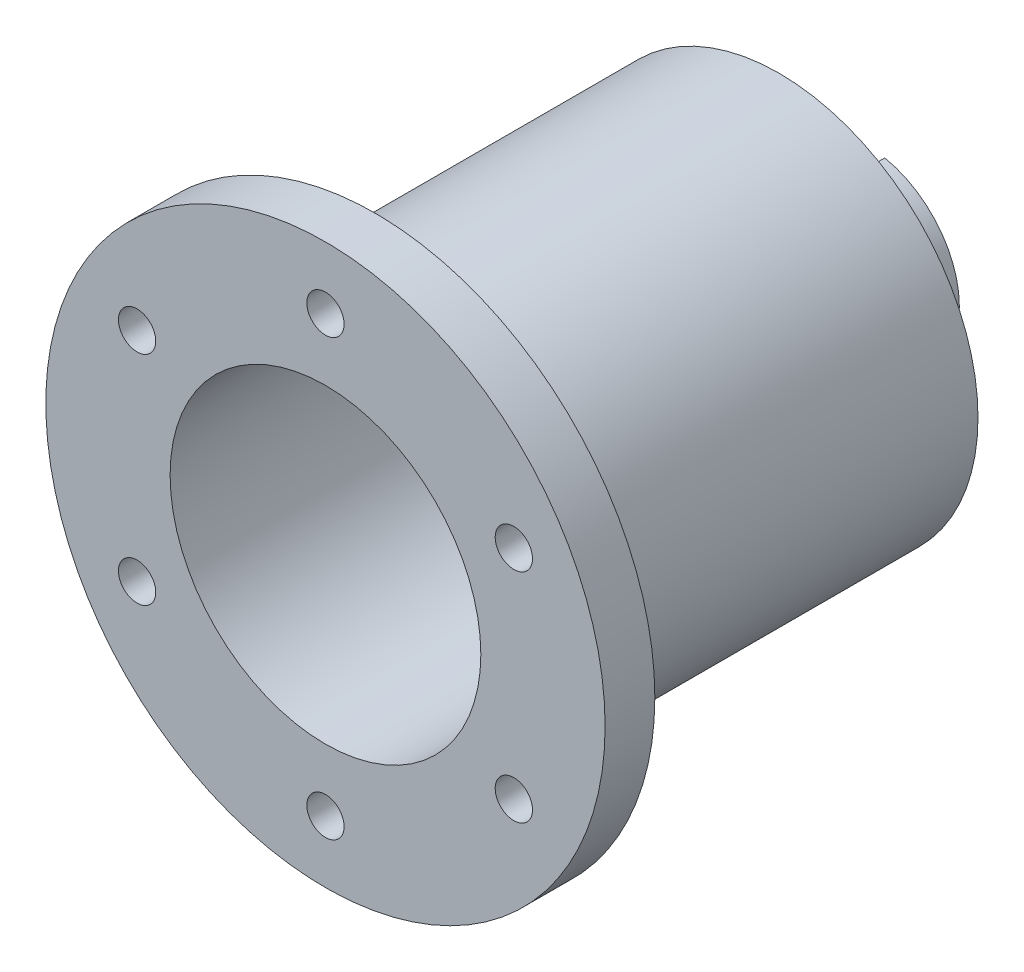
ISO-10303-21;
HEADER;
FILE_DESCRIPTION(('STEP AP214'),'2;1');
FILE_NAME('part.step','',(''),(''),'','','');
FILE_SCHEMA(('AUTOMOTIVE_DESIGN { 1 0 10303 214 1 1 1 1 }'));
ENDSEC;
DATA;
#1=APPLICATION_CONTEXT('core data for automotive mechanical design processes');
#2=APPLICATION_PROTOCOL_DEFINITION('international standard','automotive_design',2000,#1);
#3=PRODUCT_CONTEXT('',#1,'mechanical');
#4=PRODUCT('Part','Part','',(#3));
#5=PRODUCT_RELATED_PRODUCT_CATEGORY('part','',(#4));
#6=PRODUCT_DEFINITION_FORMATION('','',#4);
#7=PRODUCT_DEFINITION_CONTEXT('part definition',#1,'design');
#8=PRODUCT_DEFINITION('design','',#6,#7);
#9=PRODUCT_DEFINITION_SHAPE('','',#8);
#10=(LENGTH_UNIT() NAMED_UNIT(*) SI_UNIT(.MILLI.,.METRE.));
#11=(NAMED_UNIT(*) PLANE_ANGLE_UNIT() SI_UNIT($,.RADIAN.));
#12=(NAMED_UNIT(*) SI_UNIT($,.STERADIAN.) SOLID_ANGLE_UNIT());
#13=UNCERTAINTY_MEASURE_WITH_UNIT(LENGTH_MEASURE(1.E-05),#10,'distance_accuracy_value','');
#14=(GEOMETRIC_REPRESENTATION_CONTEXT(3) GLOBAL_UNCERTAINTY_ASSIGNED_CONTEXT((#13)) GLOBAL_UNIT_ASSIGNED_CONTEXT((#10,
#11,#12)) REPRESENTATION_CONTEXT('',''));
#15=CARTESIAN_POINT('',(0.,0.,0.));
#16=DIRECTION('',(0.,0.,1.));
#17=DIRECTION('',(1.,0.,0.));
#18=AXIS2_PLACEMENT_3D('',#15,#16,#17);
#19=CARTESIAN_POINT('',(0.,0.,17.0000000000001));
#20=DIRECTION('',(0.,0.,-1.));
#21=DIRECTION('',(-1.,0.,0.));
#22=AXIS2_PLACEMENT_3D('',#19,#20,#21);
#23=CYLINDRICAL_SURFACE('',#22,10.);
#24=CARTESIAN_POINT('',(0.,0.,-57.));
#25=DIRECTION('',(0.,0.,1.));
#26=DIRECTION('',(1.,0.,0.));
#27=AXIS2_PLACEMENT_3D('',#24,#25,#26);
#28=CIRCLE('',#27,10.);
#29=CARTESIAN_POINT('',(10.,0.,-57.));
#30=VERTEX_POINT('',#29);
#31=EDGE_CURVE('E284',#30,#30,#28,.F.);
#32=ORIENTED_EDGE('',*,*,#31,.F.);
#33=EDGE_LOOP('',(#32));
#34=FACE_BOUND('',#33,.T.);
#35=DIRECTION('',(0.,0.,-1.));
#36=VECTOR('',#35,1.);
#37=CARTESIAN_POINT('',(-2.99999999999999,9.53939201416946,17.0000000000001));
#38=LINE('',#37,#36);
#39=CARTESIAN_POINT('',(-3.,9.53939201416946,-68.));
#40=VERTEX_POINT('',#39);
#41=CARTESIAN_POINT('',(-3.,9.53939201416946,-79.));
#42=VERTEX_POINT('',#41);
#43=EDGE_CURVE('E184',#40,#42,#38,.T.);
#44=ORIENTED_EDGE('',*,*,#43,.F.);
#45=CARTESIAN_POINT('',(3.,9.53939201416946,-68.));
#46=CARTESIAN_POINT('',(3.00001027845728,9.53938054248207,-67.9176644791773));
#47=CARTESIAN_POINT('',(2.99661062684473,9.54045772064378,-67.8353355449368));
#48=CARTESIAN_POINT('',(2.98307142899347,9.54470412105986,-67.6713060472345));
#49=CARTESIAN_POINT('',(2.97293339805418,9.54787287296848,-67.5896053466756));
#50=CARTESIAN_POINT('',(2.94603140625045,9.55620668351003,-67.4276150843268));
#51=CARTESIAN_POINT('',(2.92928426957737,9.56136667250114,-67.347322475957));
#52=CARTESIAN_POINT('',(2.88932853030395,9.57351626651178,-67.1885241558658));
#53=CARTESIAN_POINT('',(2.86611975872641,9.58050591937828,-67.1100184909326));
#54=CARTESIAN_POINT('',(2.78708584446024,9.60391637654136,-66.8780506120099));
#55=CARTESIAN_POINT('',(2.72181852542973,9.62279007830391,-66.727931561167));
#56=CARTESIAN_POINT('',(2.56815043531276,9.66493213967819,-66.440773956021));
#57=CARTESIAN_POINT('',(2.4797388992416,9.68820254290641,-66.3037415292378));
#58=CARTESIAN_POINT('',(2.27929879634443,9.73733650515374,-66.0422770120522));
#59=CARTESIAN_POINT('',(2.16666914746584,9.76325505469874,-65.9183151259391));
#60=CARTESIAN_POINT('',(1.92227736150433,9.81429628475077,-65.6907263851612));
#61=CARTESIAN_POINT('',(1.79051199848164,9.8394188301941,-65.587102966139));
#62=CARTESIAN_POINT('',(1.50821997465697,9.88666477976534,-65.4010731349054));
#63=CARTESIAN_POINT('',(1.35736167401016,9.90871541546877,-65.3191498202174));
#64=CARTESIAN_POINT('',(1.04324233568303,9.94668940088144,-65.1820229959971));
#65=CARTESIAN_POINT('',(0.879984508687986,9.96261433032403,-65.126812596632));
#66=CARTESIAN_POINT('',(0.550649404820604,9.98615279768398,-65.046240448209));
#67=CARTESIAN_POINT('',(0.384786253016204,9.99399098526792,-65.0200702964824));
#68=CARTESIAN_POINT('',(0.0508471415689271,10.0012640407204,-64.995765304854));
#69=CARTESIAN_POINT('',(-0.11722839312534,10.0007004995012,-64.9976251573218));
#70=CARTESIAN_POINT('',(-0.445143199271826,9.99139205125586,-65.0287858206915));
#71=CARTESIAN_POINT('',(-0.60507429076303,9.98290831016512,-65.0572106908081));
#72=CARTESIAN_POINT('',(-0.917780104370315,9.95903027401822,-65.1392632696255));
#73=CARTESIAN_POINT('',(-1.07055445110879,9.94363561692558,-65.1928922986827));
#74=CARTESIAN_POINT('',(-1.36669563173911,9.90730429851782,-65.3244244435247));
#75=CARTESIAN_POINT('',(-1.50993201207612,9.88630511384915,-65.4026032887761));
#76=CARTESIAN_POINT('',(-1.781531059161,9.84099249303647,-65.5807971800344));
#77=CARTESIAN_POINT('',(-1.9098903832325,9.81667831471806,-65.6808171189407));
#78=CARTESIAN_POINT('',(-2.15330901082205,9.7662334714278,-65.9043839761846));
#79=CARTESIAN_POINT('',(-2.26766702955975,9.74006890899097,-66.0286877275262));
#80=CARTESIAN_POINT('',(-2.47413538985066,9.68968430229327,-66.2949948468511));
#81=CARTESIAN_POINT('',(-2.5662392402618,9.66546482675134,-66.4370033607298));
#82=CARTESIAN_POINT('',(-2.72632814481701,9.62154457591303,-66.7365618568999));
#83=CARTESIAN_POINT('',(-2.79406012682262,9.60189192491895,-66.8942543591871));
#84=CARTESIAN_POINT('',(-2.90171772009404,9.56991327306402,-67.2194490079631));
#85=CARTESIAN_POINT('',(-2.94168586436072,9.55757606951749,-67.3869357214287));
#86=CARTESIAN_POINT('',(-2.97802407180159,9.54628064650012,-67.6299897781404));
#87=CARTESIAN_POINT('',(-2.98626405978017,9.54370312550533,-67.7037814683592));
#88=CARTESIAN_POINT('',(-2.99724711229708,9.54025857223564,-67.851702958199));
#89=CARTESIAN_POINT('',(-2.99999825936538,9.53938902493288,-67.9258320993277));
#90=CARTESIAN_POINT('',(-3.,9.53939201416946,-68.));
#91=B_SPLINE_CURVE_WITH_KNOTS('',3,(#45,#46,#47,#48,#49,#50,#51,#52,#53,#54,#55,#56,#57,#58,#59,
#60,#61,#62,#63,#64,#65,#66,#67,#68,#69,#70,#71,#72,#73,#74,#75,#76,#77,#78,#79,#80,#81,#82,#83,
#84,#85,#86,#87,#88,#89,#90),.UNSPECIFIED.,.F.,.F.,(4,2,2,2,2,2,2,2,2,2,2,2,2,2,2,2,2,2,2,2,2,2,
4),(0.,0.246918142439488,0.493780777706094,0.740019009623012,0.986263681482027,1.47813347402025,
1.97023245590778,2.47635119822767,2.98255536239033,3.49922810620071,4.01576751791672,
4.51753600864764,5.01920948804101,5.50490358251093,5.99062312360832,6.48200583350621,
6.9734987373917,7.48389234847122,7.99443465298715,8.51013494368214,9.02504345105574,
9.24774267716779,9.47011372732391),.UNSPECIFIED.);
#92=CARTESIAN_POINT('',(3.,9.53939201416945,-68.));
#93=VERTEX_POINT('',#92);
#94=EDGE_CURVE('E187',#93,#40,#91,.T.);
#95=ORIENTED_EDGE('',*,*,#94,.F.);
#96=DIRECTION('',(0.,0.,-1.));
#97=VECTOR('',#96,1.);
#98=CARTESIAN_POINT('',(3.00000000000001,9.53939201416945,17.0000000000001));
#99=LINE('',#98,#97);
#100=CARTESIAN_POINT('',(3.,9.53939201416946,-79.));
#101=VERTEX_POINT('',#100);
#102=EDGE_CURVE('E150',#101,#93,#99,.F.);
#103=ORIENTED_EDGE('',*,*,#102,.F.);
#104=CARTESIAN_POINT('',(0.,0.,-79.));
#105=DIRECTION('',(0.,0.,-1.));
#106=DIRECTION('',(-1.,0.,0.));
#107=AXIS2_PLACEMENT_3D('',#104,#105,#106);
#108=CIRCLE('',#107,10.);
#109=CARTESIAN_POINT('',(3.,-9.53939201416946,-79.));
#110=VERTEX_POINT('',#109);
#111=EDGE_CURVE('E383',#101,#110,#108,.T.);
#112=ORIENTED_EDGE('',*,*,#111,.T.);
#113=DIRECTION('',(0.,0.,-1.));
#114=VECTOR('',#113,1.);
#115=CARTESIAN_POINT('',(3.00000000000001,-9.53939201416945,17.0000000000001));
#116=LINE('',#115,#114);
#117=CARTESIAN_POINT('',(3.,-9.53939201416945,-68.));
#118=VERTEX_POINT('',#117);
#119=EDGE_CURVE('E69',#118,#110,#116,.T.);
#120=ORIENTED_EDGE('',*,*,#119,.F.);
#121=CARTESIAN_POINT('',(-3.,-9.53939201416946,-68.));
#122=CARTESIAN_POINT('',(-3.00001027845728,-9.53938054248207,-67.9176644791773));
#123=CARTESIAN_POINT('',(-2.99661062684472,-9.54045772064378,-67.8353355449368));
#124=CARTESIAN_POINT('',(-2.98307142899347,-9.54470412105986,-67.6713060472345));
#125=CARTESIAN_POINT('',(-2.97293339805418,-9.54787287296849,-67.5896053466756));
#126=CARTESIAN_POINT('',(-2.94603140625045,-9.55620668351003,-67.4276150843268));
#127=CARTESIAN_POINT('',(-2.92928426957737,-9.56136667250114,-67.347322475957));
#128=CARTESIAN_POINT('',(-2.88932853030394,-9.57351626651178,-67.1885241558658));
#129=CARTESIAN_POINT('',(-2.8661197587264,-9.58050591937828,-67.1100184909326));
#130=CARTESIAN_POINT('',(-2.78708584446024,-9.60391637654137,-66.8780506120099));
#131=CARTESIAN_POINT('',(-2.72181852542972,-9.62279007830391,-66.727931561167));
#132=CARTESIAN_POINT('',(-2.56815043531276,-9.66493213967819,-66.440773956021));
#133=CARTESIAN_POINT('',(-2.4797388992416,-9.68820254290641,-66.3037415292378));
#134=CARTESIAN_POINT('',(-2.27929879634443,-9.73733650515374,-66.0422770120522));
#135=CARTESIAN_POINT('',(-2.16666914746584,-9.76325505469874,-65.9183151259391));
#136=CARTESIAN_POINT('',(-1.92227736150433,-9.81429628475077,-65.6907263851612));
#137=CARTESIAN_POINT('',(-1.79051199848164,-9.8394188301941,-65.587102966139));
#138=CARTESIAN_POINT('',(-1.50821997465697,-9.88666477976534,-65.4010731349054));
#139=CARTESIAN_POINT('',(-1.35736167401015,-9.90871541546878,-65.3191498202174));
#140=CARTESIAN_POINT('',(-1.04324233568302,-9.94668940088144,-65.1820229959971));
#141=CARTESIAN_POINT('',(-0.879984508687977,-9.96261433032403,-65.126812596632));
#142=CARTESIAN_POINT('',(-0.550649404820594,-9.98615279768398,-65.046240448209));
#143=CARTESIAN_POINT('',(-0.384786253016196,-9.99399098526792,-65.0200702964824));
#144=CARTESIAN_POINT('',(-0.0508471415689224,-10.0012640407204,-64.995765304854));
#145=CARTESIAN_POINT('',(0.117228393125344,-10.0007004995012,-64.9976251573218));
#146=CARTESIAN_POINT('',(0.445143199271829,-9.99139205125586,-65.0287858206915));
#147=CARTESIAN_POINT('',(0.605074290763033,-9.98290831016512,-65.0572106908081));
#148=CARTESIAN_POINT('',(0.917780104370319,-9.95903027401822,-65.1392632696255));
#149=CARTESIAN_POINT('',(1.07055445110879,-9.94363561692558,-65.1928922986827));
#150=CARTESIAN_POINT('',(1.36669563173912,-9.90730429851782,-65.3244244435247));
#151=CARTESIAN_POINT('',(1.50993201207613,-9.88630511384915,-65.4026032887761));
#152=CARTESIAN_POINT('',(1.781531059161,-9.84099249303646,-65.5807971800344));
#153=CARTESIAN_POINT('',(1.90989038323251,-9.81667831471806,-65.6808171189407));
#154=CARTESIAN_POINT('',(2.15330901082206,-9.7662334714278,-65.9043839761846));
#155=CARTESIAN_POINT('',(2.26766702955976,-9.74006890899097,-66.0286877275262));
#156=CARTESIAN_POINT('',(2.47413538985067,-9.68968430229327,-66.2949948468511));
#157=CARTESIAN_POINT('',(2.56623924026181,-9.66546482675133,-66.4370033607298));
#158=CARTESIAN_POINT('',(2.72632814481702,-9.62154457591303,-66.7365618568999));
#159=CARTESIAN_POINT('',(2.79406012682263,-9.60189192491895,-66.8942543591872));
#160=CARTESIAN_POINT('',(2.90171772009405,-9.56991327306402,-67.2194490079632));
#161=CARTESIAN_POINT('',(2.94168586436072,-9.55757606951749,-67.3869357214287));
#162=CARTESIAN_POINT('',(2.97802407180159,-9.54628064650011,-67.6299897781404));
#163=CARTESIAN_POINT('',(2.98626405978017,-9.54370312550533,-67.7037814683592));
#164=CARTESIAN_POINT('',(2.99724711229709,-9.54025857223564,-67.851702958199));
#165=CARTESIAN_POINT('',(2.99999825936538,-9.53938902493288,-67.9258320993277));
#166=CARTESIAN_POINT('',(3.,-9.53939201416945,-68.));
#167=B_SPLINE_CURVE_WITH_KNOTS('',3,(#121,#122,#123,#124,#125,#126,#127,#128,#129,#130,#131,
#132,#133,#134,#135,#136,#137,#138,#139,#140,#141,#142,#143,#144,#145,#146,#147,#148,#149,#150,
#151,#152,#153,#154,#155,#156,#157,#158,#159,#160,#161,#162,#163,#164,#165,#166),.UNSPECIFIED.,
.F.,.F.,(4,2,2,2,2,2,2,2,2,2,2,2,2,2,2,2,2,2,2,2,2,2,4),(0.,0.246918142439488,0.493780777706094,
0.740019009623012,0.986263681482027,1.47813347402025,1.97023245590778,2.47635119822767,
2.98255536239033,3.49922810620071,4.01576751791673,4.51753600864765,5.01920948804101,
5.50490358251093,5.99062312360832,6.48200583350621,6.9734987373917,7.48389234847122,
7.99443465298716,8.51013494368215,9.02504345105574,9.24774267716779,9.47011372732391),.UNSPECIFIED.);
#168=CARTESIAN_POINT('',(-3.,-9.53939201416946,-68.));
#169=VERTEX_POINT('',#168);
#170=EDGE_CURVE('E195',#169,#118,#167,.T.);
#171=ORIENTED_EDGE('',*,*,#170,.F.);
#172=DIRECTION('',(0.,0.,-1.));
#173=VECTOR('',#172,1.);
#174=CARTESIAN_POINT('',(-2.99999999999999,-9.53939201416946,17.0000000000001));
#175=LINE('',#174,#173);
#176=CARTESIAN_POINT('',(-3.,-9.53939201416946,-79.));
#177=VERTEX_POINT('',#176);
#178=EDGE_CURVE('E178',#177,#169,#175,.F.);
#179=ORIENTED_EDGE('',*,*,#178,.F.);
#180=EDGE_CURVE('E289',#177,#42,#108,.T.);
#181=ORIENTED_EDGE('',*,*,#180,.T.);
#182=EDGE_LOOP('',(#44,#95,#103,#112,#120,#171,#179,#181));
#183=FACE_BOUND('',#182,.T.);
#184=ADVANCED_FACE('F39',(#34,#183),#23,.F.);
#185=CARTESIAN_POINT('',(0.,0.,-79.));
#186=DIRECTION('',(0.,0.,1.));
#187=DIRECTION('',(1.,0.,0.));
#188=AXIS2_PLACEMENT_3D('',#185,#186,#187);
#189=CYLINDRICAL_SURFACE('',#188,15.);
#190=DIRECTION('',(0.,0.,1.));
#191=VECTOR('',#190,1.);
#192=CARTESIAN_POINT('',(-3.,-14.6969384566991,-79.));
#193=LINE('',#192,#191);
#194=CARTESIAN_POINT('',(-3.,-14.6969384566991,-68.));
#195=VERTEX_POINT('',#194);
#196=CARTESIAN_POINT('',(-3.,-14.6969384566991,-79.));
#197=VERTEX_POINT('',#196);
#198=EDGE_CURVE('E175',#195,#197,#193,.F.);
#199=ORIENTED_EDGE('',*,*,#198,.F.);
#200=CARTESIAN_POINT('',(3.,-14.6969384566991,-68.));
#201=CARTESIAN_POINT('',(3.00000906327289,-14.6969312244577,-67.9165231914215));
#202=CARTESIAN_POINT('',(2.99651591463672,-14.6976495056175,-67.8330513897383));
#203=CARTESIAN_POINT('',(2.98259549441824,-14.7004835434339,-67.666721900031));
#204=CARTESIAN_POINT('',(2.97216908062491,-14.7025991272148,-67.5838641373195));
#205=CARTESIAN_POINT('',(2.94447346178658,-14.708170006848,-67.4194709040174));
#206=CARTESIAN_POINT('',(2.92721468106148,-14.7116232616092,-67.3379336151037));
#207=CARTESIAN_POINT('',(2.88600721568467,-14.7197622168639,-67.1766535872965));
#208=CARTESIAN_POINT('',(2.86205850372287,-14.7244479223887,-67.0969108557303));
#209=CARTESIAN_POINT('',(2.78041527952091,-14.7401631005323,-66.861194294385));
#210=CARTESIAN_POINT('',(2.71290158046862,-14.7528553636172,-66.7086019420435));
#211=CARTESIAN_POINT('',(2.55375565119918,-14.7812320879208,-66.4169726172537));
#212=CARTESIAN_POINT('',(2.46212092124305,-14.7969168592162,-66.2779370517862));
#213=CARTESIAN_POINT('',(2.25594334606256,-14.829758124629,-66.0153294220437));
#214=CARTESIAN_POINT('',(2.14112719277709,-14.8469306312349,-65.891973547517));
#215=CARTESIAN_POINT('',(1.89243128558791,-14.8806728038384,-65.6661342875616));
#216=CARTESIAN_POINT('',(1.75854858340981,-14.8972423761055,-65.5636541361286));
#217=CARTESIAN_POINT('',(1.47408029245692,-14.9280843032166,-65.3816339470137));
#218=CARTESIAN_POINT('',(1.32335950974471,-14.9423354158867,-65.3023012663831));
#219=CARTESIAN_POINT('',(1.01040357091221,-14.9667526662081,-65.1701721723564));
#220=CARTESIAN_POINT('',(0.848170122016175,-14.9769194080515,-65.1173718337991));
#221=CARTESIAN_POINT('',(0.519052235967757,-14.9919095326336,-65.0404789003166));
#222=CARTESIAN_POINT('',(0.352257106220375,-14.996801475465,-65.0160176437936));
#223=CARTESIAN_POINT('',(0.0168596277551987,-15.0009276525647,-64.9953470494404));
#224=CARTESIAN_POINT('',(-0.151742587839107,-15.0001623007697,-64.9991356446056));
#225=CARTESIAN_POINT('',(-0.483426607616177,-14.9931130332671,-65.0345786043275));
#226=CARTESIAN_POINT('',(-0.646552839896434,-14.9869079049386,-65.0658351505753));
#227=CARTESIAN_POINT('',(-0.965196019837502,-14.9697652350655,-65.1546955300671));
#228=CARTESIAN_POINT('',(-1.12071271847091,-14.9588275387594,-65.2123002249353));
#229=CARTESIAN_POINT('',(-1.42086081389147,-14.9333186736123,-65.3525912107189));
#230=CARTESIAN_POINT('',(-1.5654171804367,-14.918724971732,-65.4354337608403));
#231=CARTESIAN_POINT('',(-1.83871931366188,-14.8875135488761,-65.6237308107676));
#232=CARTESIAN_POINT('',(-1.96746376866397,-14.8708956602115,-65.7291871845144));
#233=CARTESIAN_POINT('',(-2.20783861961223,-14.8371311210549,-65.9618850848928));
#234=CARTESIAN_POINT('',(-2.31913408498718,-14.8199802972521,-66.0894722062193));
#235=CARTESIAN_POINT('',(-2.51883269969927,-14.7873511834928,-66.3617142754621));
#236=CARTESIAN_POINT('',(-2.60722950726484,-14.7718733575622,-66.5063739354975));
#237=CARTESIAN_POINT('',(-2.75873986393405,-14.7443319012696,-66.809157214839));
#238=CARTESIAN_POINT('',(-2.82178462990344,-14.7322775849504,-66.9673160701901));
#239=CARTESIAN_POINT('',(-2.9202212919898,-14.7130848318748,-67.2921758937668));
#240=CARTESIAN_POINT('',(-2.95565438245299,-14.7059390738486,-67.4588637399443));
#241=CARTESIAN_POINT('',(-2.98449881436589,-14.7000953157589,-67.6890704505393));
#242=CARTESIAN_POINT('',(-2.99031376696653,-14.6989127961598,-67.7511624193473));
#243=CARTESIAN_POINT('',(-2.99805949399395,-14.6973350216032,-67.8754935924123));
#244=CARTESIAN_POINT('',(-2.99999676871397,-14.6969384491447,-67.9377323748674));
#245=CARTESIAN_POINT('',(-3.,-14.6969384566991,-68.));
#246=B_SPLINE_CURVE_WITH_KNOTS('',3,(#200,#201,#202,#203,#204,#205,#206,#207,#208,#209,#210,
#211,#212,#213,#214,#215,#216,#217,#218,#219,#220,#221,#222,#223,#224,#225,#226,#227,#228,#229,
#230,#231,#232,#233,#234,#235,#236,#237,#238,#239,#240,#241,#242,#243,#244,#245),.UNSPECIFIED.,
.F.,.F.,(4,2,2,2,2,2,2,2,2,2,2,2,2,2,2,2,2,2,2,2,2,2,4),(0.,0.250345531073754,0.500660094964587,
0.75059421028437,1.00052934591732,1.50000829362269,1.99953902430944,2.50534477833307,
3.01122883056536,3.52151451068939,4.03172467755666,4.53522025544509,5.03867899358442,
5.53496413269304,6.03126550223829,6.53070440104675,7.03018470288858,7.53831354930086,
8.04658297164637,8.55622223384241,9.06509969273805,9.25212746067475,9.43884144366995),.UNSPECIFIED.);
#247=CARTESIAN_POINT('',(0.,-15.,-65.));
#248=VERTEX_POINT('',#247);
#249=EDGE_CURVE('E11',#248,#195,#246,.T.);
#250=ORIENTED_EDGE('',*,*,#249,.F.);
#251=CARTESIAN_POINT('',(0.,0.,-65.));
#252=DIRECTION('',(0.,0.,-1.));
#253=DIRECTION('',(-1.,0.,0.));
#254=AXIS2_PLACEMENT_3D('',#251,#252,#253);
#255=CIRCLE('',#254,15.);
#256=CARTESIAN_POINT('',(0.,15.,-65.));
#257=VERTEX_POINT('',#256);
#258=EDGE_CURVE('E380',#248,#257,#255,.T.);
#259=ORIENTED_EDGE('',*,*,#258,.T.);
#260=CARTESIAN_POINT('',(-3.,14.6969384566991,-68.));
#261=CARTESIAN_POINT('',(-3.00000906327289,14.6969312244577,-67.9165231914215));
#262=CARTESIAN_POINT('',(-2.99651591463671,14.6976495056175,-67.8330513897383));
#263=CARTESIAN_POINT('',(-2.98259549441824,14.7004835434339,-67.666721900031));
#264=CARTESIAN_POINT('',(-2.97216908062491,14.7025991272148,-67.5838641373195));
#265=CARTESIAN_POINT('',(-2.94447346178657,14.708170006848,-67.4194709040174));
#266=CARTESIAN_POINT('',(-2.92721468106147,14.7116232616092,-67.3379336151037));
#267=CARTESIAN_POINT('',(-2.88600721568467,14.7197622168639,-67.1766535872965));
#268=CARTESIAN_POINT('',(-2.86205850372287,14.7244479223887,-67.0969108557303));
#269=CARTESIAN_POINT('',(-2.78041527952091,14.7401631005323,-66.861194294385));
#270=CARTESIAN_POINT('',(-2.71290158046862,14.7528553636172,-66.7086019420435));
#271=CARTESIAN_POINT('',(-2.55375565119918,14.7812320879208,-66.4169726172537));
#272=CARTESIAN_POINT('',(-2.46212092124304,14.7969168592162,-66.2779370517862));
#273=CARTESIAN_POINT('',(-2.25594334606255,14.829758124629,-66.0153294220437));
#274=CARTESIAN_POINT('',(-2.14112719277709,14.8469306312349,-65.891973547517));
#275=CARTESIAN_POINT('',(-1.89243128558791,14.8806728038384,-65.6661342875616));
#276=CARTESIAN_POINT('',(-1.75854858340981,14.8972423761055,-65.5636541361286));
#277=CARTESIAN_POINT('',(-1.47408029245692,14.9280843032166,-65.3816339470137));
#278=CARTESIAN_POINT('',(-1.3233595097447,14.9423354158867,-65.3023012663831));
#279=CARTESIAN_POINT('',(-1.0104035709122,14.9667526662081,-65.1701721723564));
#280=CARTESIAN_POINT('',(-0.848170122016169,14.9769194080515,-65.1173718337991));
#281=CARTESIAN_POINT('',(-0.519052235967753,14.9919095326336,-65.0404789003166));
#282=CARTESIAN_POINT('',(-0.352257106220371,14.996801475465,-65.0160176437936));
#283=CARTESIAN_POINT('',(-0.0168596277551941,15.0009276525647,-64.9953470494404));
#284=CARTESIAN_POINT('',(0.151742587839112,15.0001623007697,-64.9991356446056));
#285=CARTESIAN_POINT('',(0.483426607616182,14.9931130332671,-65.0345786043275));
#286=CARTESIAN_POINT('',(0.646552839896439,14.9869079049386,-65.0658351505753));
#287=CARTESIAN_POINT('',(0.965196019837506,14.9697652350655,-65.1546955300671));
#288=CARTESIAN_POINT('',(1.12071271847091,14.9588275387594,-65.2123002249353));
#289=CARTESIAN_POINT('',(1.42086081389148,14.9333186736123,-65.3525912107189));
#290=CARTESIAN_POINT('',(1.5654171804367,14.918724971732,-65.4354337608403));
#291=CARTESIAN_POINT('',(1.83871931366189,14.8875135488761,-65.6237308107676));
#292=CARTESIAN_POINT('',(1.96746376866397,14.8708956602115,-65.7291871845144));
#293=CARTESIAN_POINT('',(2.20783861961223,14.8371311210549,-65.9618850848928));
#294=CARTESIAN_POINT('',(2.31913408498719,14.8199802972521,-66.0894722062193));
#295=CARTESIAN_POINT('',(2.51883269969928,14.7873511834928,-66.3617142754621));
#296=CARTESIAN_POINT('',(2.60722950726484,14.7718733575622,-66.5063739354975));
#297=CARTESIAN_POINT('',(2.75873986393405,14.7443319012696,-66.809157214839));
#298=CARTESIAN_POINT('',(2.82178462990344,14.7322775849504,-66.9673160701901));
#299=CARTESIAN_POINT('',(2.9202212919898,14.7130848318748,-67.2921758937668));
#300=CARTESIAN_POINT('',(2.955654382453,14.7059390738486,-67.4588637399443));
#301=CARTESIAN_POINT('',(2.9844988143659,14.7000953157589,-67.6890704505393));
#302=CARTESIAN_POINT('',(2.99031376696653,14.6989127961598,-67.7511624193473));
#303=CARTESIAN_POINT('',(2.99805949399396,14.6973350216032,-67.8754935924123));
#304=CARTESIAN_POINT('',(2.99999676871397,14.6969384491447,-67.9377323748674));
#305=CARTESIAN_POINT('',(3.,14.6969384566991,-68.));
#306=B_SPLINE_CURVE_WITH_KNOTS('',3,(#260,#261,#262,#263,#264,#265,#266,#267,#268,#269,#270,
#271,#272,#273,#274,#275,#276,#277,#278,#279,#280,#281,#282,#283,#284,#285,#286,#287,#288,#289,
#290,#291,#292,#293,#294,#295,#296,#297,#298,#299,#300,#301,#302,#303,#304,#305),.UNSPECIFIED.,
.F.,.F.,(4,2,2,2,2,2,2,2,2,2,2,2,2,2,2,2,2,2,2,2,2,2,4),(0.,0.250345531073754,0.500660094964587,
0.75059421028437,1.00052934591732,1.50000829362269,1.99953902430944,2.50534477833307,
3.01122883056536,3.52151451068939,4.03172467755666,4.53522025544509,5.03867899358442,
5.53496413269304,6.03126550223829,6.53070440104675,7.03018470288858,7.53831354930086,
8.04658297164637,8.55622223384241,9.06509969273805,9.25212746067475,9.43884144366995),.UNSPECIFIED.);
#307=CARTESIAN_POINT('',(-3.,14.6969384566991,-68.));
#308=VERTEX_POINT('',#307);
#309=EDGE_CURVE('E142',#308,#257,#306,.T.);
#310=ORIENTED_EDGE('',*,*,#309,.F.);
#311=DIRECTION('',(0.,0.,1.));
#312=VECTOR('',#311,1.);
#313=CARTESIAN_POINT('',(-3.,14.6969384566991,-79.));
#314=LINE('',#313,#312);
#315=CARTESIAN_POINT('',(-3.,14.6969384566991,-79.));
#316=VERTEX_POINT('',#315);
#317=EDGE_CURVE('E181',#316,#308,#314,.T.);
#318=ORIENTED_EDGE('',*,*,#317,.F.);
#319=CARTESIAN_POINT('',(0.,0.,-79.));
#320=DIRECTION('',(0.,0.,-1.));
#321=DIRECTION('',(-1.,0.,0.));
#322=AXIS2_PLACEMENT_3D('',#319,#320,#321);
#323=CIRCLE('',#322,15.);
#324=EDGE_CURVE('E297',#197,#316,#323,.T.);
#325=ORIENTED_EDGE('',*,*,#324,.F.);
#326=EDGE_LOOP('',(#199,#250,#259,#310,#318,#325));
#327=FACE_BOUND('',#326,.T.);
#328=ADVANCED_FACE('F224',(#327),#189,.T.);
#329=CARTESIAN_POINT('',(3.,-14.6969384566991,-68.));
#330=VERTEX_POINT('',#329);
#331=EDGE_CURVE('E43',#330,#248,#246,.T.);
#332=ORIENTED_EDGE('',*,*,#331,.F.);
#333=DIRECTION('',(0.,0.,1.));
#334=VECTOR('',#333,1.);
#335=CARTESIAN_POINT('',(3.,-14.6969384566991,-79.));
#336=LINE('',#335,#334);
#337=CARTESIAN_POINT('',(3.,-14.6969384566991,-79.));
#338=VERTEX_POINT('',#337);
#339=EDGE_CURVE('E166',#338,#330,#336,.T.);
#340=ORIENTED_EDGE('',*,*,#339,.F.);
#341=CARTESIAN_POINT('',(3.,14.6969384566991,-79.));
#342=VERTEX_POINT('',#341);
#343=EDGE_CURVE('E160',#342,#338,#323,.T.);
#344=ORIENTED_EDGE('',*,*,#343,.F.);
#345=DIRECTION('',(0.,0.,1.));
#346=VECTOR('',#345,1.);
#347=CARTESIAN_POINT('',(3.,14.6969384566991,-79.));
#348=LINE('',#347,#346);
#349=CARTESIAN_POINT('',(3.,14.6969384566991,-68.));
#350=VERTEX_POINT('',#349);
#351=EDGE_CURVE('E61',#350,#342,#348,.F.);
#352=ORIENTED_EDGE('',*,*,#351,.F.);
#353=EDGE_CURVE('E136',#257,#350,#306,.T.);
#354=ORIENTED_EDGE('',*,*,#353,.F.);
#355=EDGE_CURVE('E307',#257,#248,#255,.T.);
#356=ORIENTED_EDGE('',*,*,#355,.T.);
#357=EDGE_LOOP('',(#332,#340,#344,#352,#354,#356));
#358=FACE_BOUND('',#357,.T.);
#359=ADVANCED_FACE('F157',(#358),#189,.T.);
#360=CARTESIAN_POINT('',(0.,0.,-79.));
#361=DIRECTION('',(0.,0.,-1.));
#362=DIRECTION('',(-1.,0.,0.));
#363=AXIS2_PLACEMENT_3D('',#360,#361,#362);
#364=PLANE('',#363);
#365=ORIENTED_EDGE('',*,*,#324,.T.);
#366=DIRECTION('',(0.,-1.,0.));
#367=VECTOR('',#366,1.);
#368=CARTESIAN_POINT('',(-3.,0.,-79.));
#369=LINE('',#368,#367);
#370=EDGE_CURVE('E147',#316,#42,#369,.T.);
#371=ORIENTED_EDGE('',*,*,#370,.T.);
#372=ORIENTED_EDGE('',*,*,#180,.F.);
#373=EDGE_CURVE('E222',#177,#197,#369,.T.);
#374=ORIENTED_EDGE('',*,*,#373,.T.);
#375=EDGE_LOOP('',(#365,#371,#372,#374));
#376=FACE_BOUND('',#375,.T.);
#377=ADVANCED_FACE('F229',(#376),#364,.T.);
#378=ORIENTED_EDGE('',*,*,#343,.T.);
#379=DIRECTION('',(0.,1.,0.));
#380=VECTOR('',#379,1.);
#381=CARTESIAN_POINT('',(3.,0.,-79.));
#382=LINE('',#381,#380);
#383=EDGE_CURVE('E300',#338,#110,#382,.T.);
#384=ORIENTED_EDGE('',*,*,#383,.T.);
#385=ORIENTED_EDGE('',*,*,#111,.F.);
#386=EDGE_CURVE('E302',#101,#342,#382,.T.);
#387=ORIENTED_EDGE('',*,*,#386,.T.);
#388=EDGE_LOOP('',(#378,#384,#385,#387));
#389=FACE_BOUND('',#388,.T.);
#390=ADVANCED_FACE('F267',(#389),#364,.T.);
#391=CARTESIAN_POINT('',(0.,0.,8.));
#392=DIRECTION('',(0.,0.,1.));
#393=DIRECTION('',(1.,0.,0.));
#394=AXIS2_PLACEMENT_3D('',#391,#392,#393);
#395=PLANE('',#394);
#396=CARTESIAN_POINT('',(0.,0.,8.));
#397=DIRECTION('',(0.,0.,1.));
#398=DIRECTION('',(1.,0.,0.));
#399=AXIS2_PLACEMENT_3D('',#396,#397,#398);
#400=CIRCLE('',#399,25.);
#401=CARTESIAN_POINT('',(25.,0.,8.));
#402=VERTEX_POINT('',#401);
#403=EDGE_CURVE('E386',#402,#402,#400,.T.);
#404=ORIENTED_EDGE('',*,*,#403,.F.);
#405=EDGE_LOOP('',(#404));
#406=FACE_BOUND('',#405,.T.);
#407=CARTESIAN_POINT('',(-30.3108891324553,-17.5,8.));
#408=DIRECTION('',(0.,0.,1.));
#409=DIRECTION('',(1.,0.,0.));
#410=AXIS2_PLACEMENT_3D('',#407,#408,#409);
#411=CIRCLE('',#410,3.);
#412=CARTESIAN_POINT('',(-27.3108891324553,-17.5,8.));
#413=VERTEX_POINT('',#412);
#414=EDGE_CURVE('E350',#413,#413,#411,.T.);
#415=ORIENTED_EDGE('',*,*,#414,.F.);
#416=EDGE_LOOP('',(#415));
#417=FACE_BOUND('',#416,.T.);
#418=CARTESIAN_POINT('',(30.3108891324554,-17.5,8.));
#419=DIRECTION('',(0.,0.,1.));
#420=DIRECTION('',(1.,0.,0.));
#421=AXIS2_PLACEMENT_3D('',#418,#419,#420);
#422=CIRCLE('',#421,3.);
#423=CARTESIAN_POINT('',(33.3108891324554,-17.5,8.));
#424=VERTEX_POINT('',#423);
#425=EDGE_CURVE('E334',#424,#424,#422,.T.);
#426=ORIENTED_EDGE('',*,*,#425,.F.);
#427=EDGE_LOOP('',(#426));
#428=FACE_BOUND('',#427,.T.);
#429=CARTESIAN_POINT('',(0.,35.,8.));
#430=DIRECTION('',(0.,0.,1.));
#431=DIRECTION('',(1.,0.,0.));
#432=AXIS2_PLACEMENT_3D('',#429,#430,#431);
#433=CIRCLE('',#432,3.);
#434=CARTESIAN_POINT('',(3.,35.,8.));
#435=VERTEX_POINT('',#434);
#436=EDGE_CURVE('E317',#435,#435,#433,.T.);
#437=ORIENTED_EDGE('',*,*,#436,.F.);
#438=EDGE_LOOP('',(#437));
#439=FACE_BOUND('',#438,.T.);
#440=CARTESIAN_POINT('',(0.,0.,8.));
#441=DIRECTION('',(0.,0.,1.));
#442=DIRECTION('',(1.,0.,0.));
#443=AXIS2_PLACEMENT_3D('',#440,#441,#442);
#444=CIRCLE('',#443,45.);
#445=CARTESIAN_POINT('',(45.,0.,8.));
#446=VERTEX_POINT('',#445);
#447=EDGE_CURVE('E316',#446,#446,#444,.T.);
#448=ORIENTED_EDGE('',*,*,#447,.T.);
#449=EDGE_LOOP('',(#448));
#450=FACE_BOUND('',#449,.T.);
#451=CARTESIAN_POINT('',(-30.3108891324554,17.5,8.));
#452=DIRECTION('',(0.,0.,1.));
#453=DIRECTION('',(1.,0.,0.));
#454=AXIS2_PLACEMENT_3D('',#451,#452,#453);
#455=CIRCLE('',#454,3.);
#456=CARTESIAN_POINT('',(-27.3108891324554,17.5,8.));
#457=VERTEX_POINT('',#456);
#458=EDGE_CURVE('E326',#457,#457,#455,.T.);
#459=ORIENTED_EDGE('',*,*,#458,.F.);
#460=EDGE_LOOP('',(#459));
#461=FACE_BOUND('',#460,.T.);
#462=CARTESIAN_POINT('',(30.3108891324553,17.5,8.));
#463=DIRECTION('',(0.,0.,1.));
#464=DIRECTION('',(1.,0.,0.));
#465=AXIS2_PLACEMENT_3D('',#462,#463,#464);
#466=CIRCLE('',#465,3.);
#467=CARTESIAN_POINT('',(33.3108891324554,17.5,8.));
#468=VERTEX_POINT('',#467);
#469=EDGE_CURVE('E342',#468,#468,#466,.T.);
#470=ORIENTED_EDGE('',*,*,#469,.F.);
#471=EDGE_LOOP('',(#470));
#472=FACE_BOUND('',#471,.T.);
#473=CARTESIAN_POINT('',(0.,-35.,8.));
#474=DIRECTION('',(0.,0.,1.));
#475=DIRECTION('',(1.,0.,0.));
#476=AXIS2_PLACEMENT_3D('',#473,#474,#475);
#477=CIRCLE('',#476,3.);
#478=CARTESIAN_POINT('',(3.00000000000003,-35.,8.));
#479=VERTEX_POINT('',#478);
#480=EDGE_CURVE('E358',#479,#479,#477,.T.);
#481=ORIENTED_EDGE('',*,*,#480,.F.);
#482=EDGE_LOOP('',(#481));
#483=FACE_BOUND('',#482,.T.);
#484=ADVANCED_FACE('F264',(#406,#417,#428,#439,#450,#461,#472,#483),#395,.T.);
#485=CARTESIAN_POINT('',(0.,0.,0.));
#486=DIRECTION('',(0.,0.,1.));
#487=DIRECTION('',(1.,0.,0.));
#488=AXIS2_PLACEMENT_3D('',#485,#486,#487);
#489=PLANE('',#488);
#490=CARTESIAN_POINT('',(0.,0.,0.));
#491=DIRECTION('',(0.,0.,-1.));
#492=DIRECTION('',(-1.,0.,0.));
#493=AXIS2_PLACEMENT_3D('',#490,#491,#492);
#494=CIRCLE('',#493,32.);
#495=CARTESIAN_POINT('',(-27.712812921102,16.,0.));
#496=VERTEX_POINT('',#495);
#497=CARTESIAN_POINT('',(0.,32.,0.));
#498=VERTEX_POINT('',#497);
#499=EDGE_CURVE('E370',#496,#498,#494,.T.);
#500=ORIENTED_EDGE('',*,*,#499,.F.);
#501=CARTESIAN_POINT('',(-30.3108891324554,17.5,0.));
#502=DIRECTION('',(0.,0.,1.));
#503=DIRECTION('',(1.,0.,0.));
#504=AXIS2_PLACEMENT_3D('',#501,#502,#503);
#505=CIRCLE('',#504,3.);
#506=EDGE_CURVE('E330',#496,#496,#505,.T.);
#507=ORIENTED_EDGE('',*,*,#506,.T.);
#508=CARTESIAN_POINT('',(-27.712812921102,-16.,0.));
#509=VERTEX_POINT('',#508);
#510=EDGE_CURVE('E321',#509,#496,#494,.T.);
#511=ORIENTED_EDGE('',*,*,#510,.F.);
#512=CARTESIAN_POINT('',(-30.3108891324553,-17.5,0.));
#513=DIRECTION('',(0.,0.,1.));
#514=DIRECTION('',(1.,0.,0.));
#515=AXIS2_PLACEMENT_3D('',#512,#513,#514);
#516=CIRCLE('',#515,3.);
#517=EDGE_CURVE('E354',#509,#509,#516,.T.);
#518=ORIENTED_EDGE('',*,*,#517,.T.);
#519=CARTESIAN_POINT('',(0.,-32.,0.));
#520=VERTEX_POINT('',#519);
#521=EDGE_CURVE('E421',#520,#509,#494,.T.);
#522=ORIENTED_EDGE('',*,*,#521,.F.);
#523=CARTESIAN_POINT('',(0.,-35.,0.));
#524=DIRECTION('',(0.,0.,1.));
#525=DIRECTION('',(1.,0.,0.));
#526=AXIS2_PLACEMENT_3D('',#523,#524,#525);
#527=CIRCLE('',#526,3.);
#528=EDGE_CURVE('E362',#520,#520,#527,.T.);
#529=ORIENTED_EDGE('',*,*,#528,.T.);
#530=CARTESIAN_POINT('',(27.712812921102,-16.,0.));
#531=VERTEX_POINT('',#530);
#532=EDGE_CURVE('E419',#531,#520,#494,.T.);
#533=ORIENTED_EDGE('',*,*,#532,.F.);
#534=CARTESIAN_POINT('',(30.3108891324554,-17.5,0.));
#535=DIRECTION('',(0.,0.,1.));
#536=DIRECTION('',(1.,0.,0.));
#537=AXIS2_PLACEMENT_3D('',#534,#535,#536);
#538=CIRCLE('',#537,3.);
#539=EDGE_CURVE('E338',#531,#531,#538,.T.);
#540=ORIENTED_EDGE('',*,*,#539,.T.);
#541=CARTESIAN_POINT('',(27.712812921102,16.,0.));
#542=VERTEX_POINT('',#541);
#543=EDGE_CURVE('E423',#542,#531,#494,.T.);
#544=ORIENTED_EDGE('',*,*,#543,.F.);
#545=CARTESIAN_POINT('',(30.3108891324553,17.5,0.));
#546=DIRECTION('',(0.,0.,1.));
#547=DIRECTION('',(1.,0.,0.));
#548=AXIS2_PLACEMENT_3D('',#545,#546,#547);
#549=CIRCLE('',#548,3.);
#550=EDGE_CURVE('E346',#542,#542,#549,.T.);
#551=ORIENTED_EDGE('',*,*,#550,.T.);
#552=EDGE_CURVE('E374',#498,#542,#494,.T.);
#553=ORIENTED_EDGE('',*,*,#552,.F.);
#554=CARTESIAN_POINT('',(0.,35.,0.));
#555=DIRECTION('',(0.,0.,1.));
#556=DIRECTION('',(1.,0.,0.));
#557=AXIS2_PLACEMENT_3D('',#554,#555,#556);
#558=CIRCLE('',#557,3.);
#559=EDGE_CURVE('E322',#498,#498,#558,.T.);
#560=ORIENTED_EDGE('',*,*,#559,.T.);
#561=EDGE_LOOP('',(#500,#507,#511,#518,#522,#529,#533,#540,#544,#551,#553,#560));
#562=FACE_BOUND('',#561,.T.);
#563=CARTESIAN_POINT('',(0.,0.,0.));
#564=DIRECTION('',(0.,0.,1.));
#565=DIRECTION('',(1.,0.,0.));
#566=AXIS2_PLACEMENT_3D('',#563,#564,#565);
#567=CIRCLE('',#566,45.);
#568=CARTESIAN_POINT('',(45.,0.,0.));
#569=VERTEX_POINT('',#568);
#570=EDGE_CURVE('E312',#569,#569,#567,.T.);
#571=ORIENTED_EDGE('',*,*,#570,.F.);
#572=EDGE_LOOP('',(#571));
#573=FACE_BOUND('',#572,.T.);
#574=ADVANCED_FACE('F266',(#562,#573),#489,.F.);
#575=CARTESIAN_POINT('',(0.,0.,8.));
#576=DIRECTION('',(0.,0.,-1.));
#577=DIRECTION('',(-1.,0.,0.));
#578=AXIS2_PLACEMENT_3D('',#575,#576,#577);
#579=CYLINDRICAL_SURFACE('',#578,45.);
#580=ORIENTED_EDGE('',*,*,#447,.F.);
#581=EDGE_LOOP('',(#580));
#582=FACE_BOUND('',#581,.T.);
#583=ORIENTED_EDGE('',*,*,#570,.T.);
#584=EDGE_LOOP('',(#583));
#585=FACE_BOUND('',#584,.T.);
#586=ADVANCED_FACE('F41',(#582,#585),#579,.T.);
#587=CARTESIAN_POINT('',(0.,35.,8.));
#588=DIRECTION('',(0.,0.,-1.));
#589=DIRECTION('',(-1.,0.,0.));
#590=AXIS2_PLACEMENT_3D('',#587,#588,#589);
#591=CYLINDRICAL_SURFACE('',#590,3.);
#592=ORIENTED_EDGE('',*,*,#436,.T.);
#593=EDGE_LOOP('',(#592));
#594=FACE_BOUND('',#593,.T.);
#595=ORIENTED_EDGE('',*,*,#559,.F.);
#596=EDGE_LOOP('',(#595));
#597=FACE_BOUND('',#596,.T.);
#598=ADVANCED_FACE('F259',(#594,#597),#591,.F.);
#599=CARTESIAN_POINT('',(-30.3108891324554,17.5,8.));
#600=DIRECTION('',(0.,0.,-1.));
#601=DIRECTION('',(-1.,0.,0.));
#602=AXIS2_PLACEMENT_3D('',#599,#600,#601);
#603=CYLINDRICAL_SURFACE('',#602,3.);
#604=ORIENTED_EDGE('',*,*,#458,.T.);
#605=EDGE_LOOP('',(#604));
#606=FACE_BOUND('',#605,.T.);
#607=ORIENTED_EDGE('',*,*,#506,.F.);
#608=EDGE_LOOP('',(#607));
#609=FACE_BOUND('',#608,.T.);
#610=ADVANCED_FACE('F255',(#606,#609),#603,.F.);
#611=CARTESIAN_POINT('',(30.3108891324554,-17.5,8.));
#612=DIRECTION('',(0.,0.,-1.));
#613=DIRECTION('',(-1.,0.,0.));
#614=AXIS2_PLACEMENT_3D('',#611,#612,#613);
#615=CYLINDRICAL_SURFACE('',#614,3.);
#616=ORIENTED_EDGE('',*,*,#425,.T.);
#617=EDGE_LOOP('',(#616));
#618=FACE_BOUND('',#617,.T.);
#619=ORIENTED_EDGE('',*,*,#539,.F.);
#620=EDGE_LOOP('',(#619));
#621=FACE_BOUND('',#620,.T.);
#622=ADVANCED_FACE('F251',(#618,#621),#615,.F.);
#623=CARTESIAN_POINT('',(30.3108891324553,17.5,8.));
#624=DIRECTION('',(0.,0.,-1.));
#625=DIRECTION('',(-1.,0.,0.));
#626=AXIS2_PLACEMENT_3D('',#623,#624,#625);
#627=CYLINDRICAL_SURFACE('',#626,3.);
#628=ORIENTED_EDGE('',*,*,#469,.T.);
#629=EDGE_LOOP('',(#628));
#630=FACE_BOUND('',#629,.T.);
#631=ORIENTED_EDGE('',*,*,#550,.F.);
#632=EDGE_LOOP('',(#631));
#633=FACE_BOUND('',#632,.T.);
#634=ADVANCED_FACE('F247',(#630,#633),#627,.F.);
#635=CARTESIAN_POINT('',(-30.3108891324553,-17.5,8.));
#636=DIRECTION('',(0.,0.,-1.));
#637=DIRECTION('',(-1.,0.,0.));
#638=AXIS2_PLACEMENT_3D('',#635,#636,#637);
#639=CYLINDRICAL_SURFACE('',#638,3.);
#640=ORIENTED_EDGE('',*,*,#414,.T.);
#641=EDGE_LOOP('',(#640));
#642=FACE_BOUND('',#641,.T.);
#643=ORIENTED_EDGE('',*,*,#517,.F.);
#644=EDGE_LOOP('',(#643));
#645=FACE_BOUND('',#644,.T.);
#646=ADVANCED_FACE('F243',(#642,#645),#639,.F.);
#647=CARTESIAN_POINT('',(0.,-35.,8.));
#648=DIRECTION('',(0.,0.,-1.));
#649=DIRECTION('',(-1.,0.,0.));
#650=AXIS2_PLACEMENT_3D('',#647,#648,#649);
#651=CYLINDRICAL_SURFACE('',#650,3.);
#652=ORIENTED_EDGE('',*,*,#480,.T.);
#653=EDGE_LOOP('',(#652));
#654=FACE_BOUND('',#653,.T.);
#655=ORIENTED_EDGE('',*,*,#528,.F.);
#656=EDGE_LOOP('',(#655));
#657=FACE_BOUND('',#656,.T.);
#658=ADVANCED_FACE('F239',(#654,#657),#651,.F.);
#659=CARTESIAN_POINT('',(0.,0.,-65.));
#660=DIRECTION('',(0.,0.,1.));
#661=DIRECTION('',(1.,0.,0.));
#662=AXIS2_PLACEMENT_3D('',#659,#660,#661);
#663=CYLINDRICAL_SURFACE('',#662,32.);
#664=CARTESIAN_POINT('',(0.,0.,-65.));
#665=DIRECTION('',(0.,0.,-1.));
#666=DIRECTION('',(-1.,0.,0.));
#667=AXIS2_PLACEMENT_3D('',#664,#665,#666);
#668=CIRCLE('',#667,32.);
#669=CARTESIAN_POINT('',(-32.,0.,-65.));
#670=VERTEX_POINT('',#669);
#671=EDGE_CURVE('E366',#670,#670,#668,.T.);
#672=ORIENTED_EDGE('',*,*,#671,.F.);
#673=EDGE_LOOP('',(#672));
#674=FACE_BOUND('',#673,.T.);
#675=ORIENTED_EDGE('',*,*,#499,.T.);
#676=ORIENTED_EDGE('',*,*,#552,.T.);
#677=ORIENTED_EDGE('',*,*,#543,.T.);
#678=ORIENTED_EDGE('',*,*,#532,.T.);
#679=ORIENTED_EDGE('',*,*,#521,.T.);
#680=ORIENTED_EDGE('',*,*,#510,.T.);
#681=EDGE_LOOP('',(#675,#676,#677,#678,#679,#680));
#682=FACE_BOUND('',#681,.T.);
#683=ADVANCED_FACE('F235',(#674,#682),#663,.T.);
#684=CARTESIAN_POINT('',(0.,0.,-65.));
#685=DIRECTION('',(0.,0.,-1.));
#686=DIRECTION('',(-1.,0.,0.));
#687=AXIS2_PLACEMENT_3D('',#684,#685,#686);
#688=PLANE('',#687);
#689=ORIENTED_EDGE('',*,*,#258,.F.);
#690=ORIENTED_EDGE('',*,*,#355,.F.);
#691=EDGE_LOOP('',(#689,#690));
#692=FACE_BOUND('',#691,.T.);
#693=ORIENTED_EDGE('',*,*,#671,.T.);
#694=EDGE_LOOP('',(#693));
#695=FACE_BOUND('',#694,.T.);
#696=ADVANCED_FACE('F230',(#692,#695),#688,.T.);
#697=CARTESIAN_POINT('',(0.,0.,-57.));
#698=DIRECTION('',(0.,0.,1.));
#699=DIRECTION('',(1.,0.,0.));
#700=AXIS2_PLACEMENT_3D('',#697,#698,#699);
#701=PLANE('',#700);
#702=CARTESIAN_POINT('',(0.,0.,-57.));
#703=DIRECTION('',(0.,0.,1.));
#704=DIRECTION('',(1.,0.,0.));
#705=AXIS2_PLACEMENT_3D('',#702,#703,#704);
#706=CIRCLE('',#705,25.);
#707=CARTESIAN_POINT('',(25.,0.,-57.));
#708=VERTEX_POINT('',#707);
#709=EDGE_CURVE('E311',#708,#708,#706,.T.);
#710=ORIENTED_EDGE('',*,*,#709,.T.);
#711=EDGE_LOOP('',(#710));
#712=FACE_BOUND('',#711,.T.);
#713=ORIENTED_EDGE('',*,*,#31,.T.);
#714=EDGE_LOOP('',(#713));
#715=FACE_BOUND('',#714,.T.);
#716=ADVANCED_FACE('F234',(#712,#715),#701,.T.);
#717=CARTESIAN_POINT('',(0.,0.,-57.));
#718=DIRECTION('',(0.,0.,1.));
#719=DIRECTION('',(1.,0.,0.));
#720=AXIS2_PLACEMENT_3D('',#717,#718,#719);
#721=CYLINDRICAL_SURFACE('',#720,25.);
#722=ORIENTED_EDGE('',*,*,#709,.F.);
#723=EDGE_LOOP('',(#722));
#724=FACE_BOUND('',#723,.T.);
#725=ORIENTED_EDGE('',*,*,#403,.T.);
#726=EDGE_LOOP('',(#725));
#727=FACE_BOUND('',#726,.T.);
#728=ADVANCED_FACE('F395',(#724,#727),#721,.F.);
#729=CARTESIAN_POINT('',(-3.,19.,-85.5900426045089));
#730=DIRECTION('',(1.,0.,0.));
#731=DIRECTION('',(0.,0.,-1.));
#732=AXIS2_PLACEMENT_3D('',#729,#730,#731);
#733=PLANE('',#732);
#734=ORIENTED_EDGE('',*,*,#43,.T.);
#735=ORIENTED_EDGE('',*,*,#370,.F.);
#736=ORIENTED_EDGE('',*,*,#317,.T.);
#737=DIRECTION('',(0.,-1.,0.));
#738=VECTOR('',#737,1.);
#739=CARTESIAN_POINT('',(-3.,19.,-68.));
#740=LINE('',#739,#738);
#741=EDGE_CURVE('E162',#308,#40,#740,.T.);
#742=ORIENTED_EDGE('',*,*,#741,.T.);
#743=EDGE_LOOP('',(#734,#735,#736,#742));
#744=FACE_BOUND('',#743,.T.);
#745=ADVANCED_FACE('F212',(#744),#733,.T.);
#746=CARTESIAN_POINT('',(3.,19.,-85.5900426045089));
#747=DIRECTION('',(-1.,0.,0.));
#748=DIRECTION('',(0.,0.,1.));
#749=AXIS2_PLACEMENT_3D('',#746,#747,#748);
#750=PLANE('',#749);
#751=ORIENTED_EDGE('',*,*,#102,.T.);
#752=DIRECTION('',(0.,-1.,0.));
#753=VECTOR('',#752,1.);
#754=CARTESIAN_POINT('',(3.,19.,-68.));
#755=LINE('',#754,#753);
#756=EDGE_CURVE('E138',#350,#93,#755,.T.);
#757=ORIENTED_EDGE('',*,*,#756,.F.);
#758=ORIENTED_EDGE('',*,*,#351,.T.);
#759=ORIENTED_EDGE('',*,*,#386,.F.);
#760=EDGE_LOOP('',(#751,#757,#758,#759));
#761=FACE_BOUND('',#760,.T.);
#762=ADVANCED_FACE('F148',(#761),#750,.T.);
#763=CARTESIAN_POINT('',(0.,19.,-68.));
#764=DIRECTION('',(0.,-1.,0.));
#765=DIRECTION('',(0.,0.,-1.));
#766=AXIS2_PLACEMENT_3D('',#763,#764,#765);
#767=CYLINDRICAL_SURFACE('',#766,3.);
#768=ORIENTED_EDGE('',*,*,#94,.T.);
#769=ORIENTED_EDGE('',*,*,#741,.F.);
#770=ORIENTED_EDGE('',*,*,#309,.T.);
#771=ORIENTED_EDGE('',*,*,#353,.T.);
#772=ORIENTED_EDGE('',*,*,#756,.T.);
#773=EDGE_LOOP('',(#768,#769,#770,#771,#772));
#774=FACE_BOUND('',#773,.T.);
#775=ADVANCED_FACE('F137',(#774),#767,.F.);
#776=ORIENTED_EDGE('',*,*,#170,.T.);
#777=EDGE_CURVE('E153',#118,#330,#755,.T.);
#778=ORIENTED_EDGE('',*,*,#777,.T.);
#779=ORIENTED_EDGE('',*,*,#331,.T.);
#780=ORIENTED_EDGE('',*,*,#249,.T.);
#781=EDGE_CURVE('E152',#169,#195,#740,.T.);
#782=ORIENTED_EDGE('',*,*,#781,.F.);
#783=EDGE_LOOP('',(#776,#778,#779,#780,#782));
#784=FACE_BOUND('',#783,.T.);
#785=ADVANCED_FACE('F204',(#784),#767,.F.);
#786=ORIENTED_EDGE('',*,*,#178,.T.);
#787=ORIENTED_EDGE('',*,*,#781,.T.);
#788=ORIENTED_EDGE('',*,*,#198,.T.);
#789=ORIENTED_EDGE('',*,*,#373,.F.);
#790=EDGE_LOOP('',(#786,#787,#788,#789));
#791=FACE_BOUND('',#790,.T.);
#792=ADVANCED_FACE('F209',(#791),#733,.T.);
#793=ORIENTED_EDGE('',*,*,#119,.T.);
#794=ORIENTED_EDGE('',*,*,#383,.F.);
#795=ORIENTED_EDGE('',*,*,#339,.T.);
#796=ORIENTED_EDGE('',*,*,#777,.F.);
#797=EDGE_LOOP('',(#793,#794,#795,#796));
#798=FACE_BOUND('',#797,.T.);
#799=ADVANCED_FACE('F211',(#798),#750,.T.);
#800=CLOSED_SHELL('',(#184,#328,#359,#377,#390,#484,#574,#586,#598,#610,#622,#634,#646,#658,
#683,#696,#716,#728,#745,#762,#775,#785,#792,#799));
#801=MANIFOLD_SOLID_BREP('B2',#800);
#802=ADVANCED_BREP_SHAPE_REPRESENTATION('',(#18,#801),#14);
#803=SHAPE_DEFINITION_REPRESENTATION(#9,#802);
ENDSEC;
END-ISO-10303-21;
